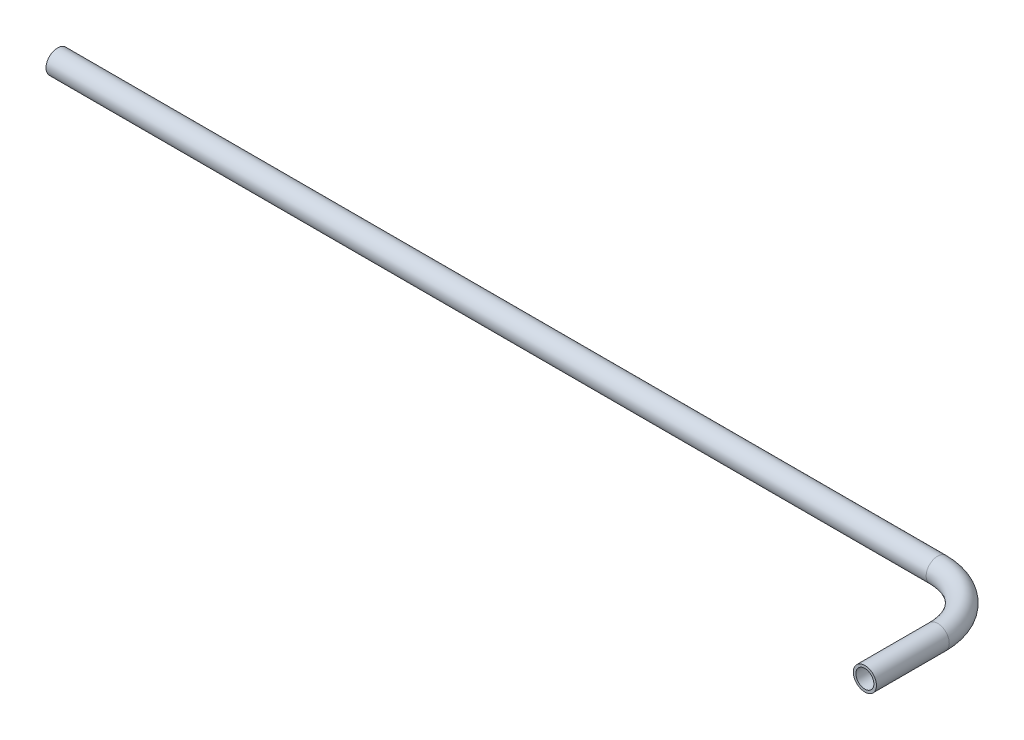
ISO-10303-21;
HEADER;
FILE_DESCRIPTION(('STEP AP214'),'2;1');
FILE_NAME('part.step','',(''),(''),'','','');
FILE_SCHEMA(('AUTOMOTIVE_DESIGN { 1 0 10303 214 1 1 1 1 }'));
ENDSEC;
DATA;
#1=APPLICATION_CONTEXT('core data for automotive mechanical design processes');
#2=APPLICATION_PROTOCOL_DEFINITION('international standard','automotive_design',2000,#1);
#3=PRODUCT_CONTEXT('',#1,'mechanical');
#4=PRODUCT('Part','Part','',(#3));
#5=PRODUCT_RELATED_PRODUCT_CATEGORY('part','',(#4));
#6=PRODUCT_DEFINITION_FORMATION('','',#4);
#7=PRODUCT_DEFINITION_CONTEXT('part definition',#1,'design');
#8=PRODUCT_DEFINITION('design','',#6,#7);
#9=PRODUCT_DEFINITION_SHAPE('','',#8);
#10=(LENGTH_UNIT() NAMED_UNIT(*) SI_UNIT(.MILLI.,.METRE.));
#11=(NAMED_UNIT(*) PLANE_ANGLE_UNIT() SI_UNIT($,.RADIAN.));
#12=(NAMED_UNIT(*) SI_UNIT($,.STERADIAN.) SOLID_ANGLE_UNIT());
#13=UNCERTAINTY_MEASURE_WITH_UNIT(LENGTH_MEASURE(1.E-05),#10,'distance_accuracy_value','');
#14=(GEOMETRIC_REPRESENTATION_CONTEXT(3) GLOBAL_UNCERTAINTY_ASSIGNED_CONTEXT((#13)) GLOBAL_UNIT_ASSIGNED_CONTEXT((#10,
#11,#12)) REPRESENTATION_CONTEXT('',''));
#15=CARTESIAN_POINT('',(0.,0.,0.));
#16=DIRECTION('',(0.,0.,1.));
#17=DIRECTION('',(1.,0.,0.));
#18=AXIS2_PLACEMENT_3D('',#15,#16,#17);
#19=CARTESIAN_POINT('',(-257.7,0.,-36.));
#20=DIRECTION('',(1.,0.,0.));
#21=DIRECTION('',(0.,0.,-1.));
#22=AXIS2_PLACEMENT_3D('',#19,#20,#21);
#23=PLANE('',#22);
#24=CARTESIAN_POINT('',(-257.7,0.,-36.));
#25=DIRECTION('',(1.,0.,0.));
#26=DIRECTION('',(0.,0.,-1.));
#27=AXIS2_PLACEMENT_3D('',#24,#25,#26);
#28=CIRCLE('',#27,2.4638);
#29=CARTESIAN_POINT('',(-257.7,0.,-38.4638));
#30=VERTEX_POINT('',#29);
#31=EDGE_CURVE('E54',#30,#30,#28,.T.);
#32=ORIENTED_EDGE('',*,*,#31,.T.);
#33=EDGE_LOOP('',(#32));
#34=FACE_BOUND('',#33,.T.);
#35=CARTESIAN_POINT('',(-257.7,0.,-36.));
#36=DIRECTION('',(1.,0.,0.));
#37=DIRECTION('',(0.,0.,-1.));
#38=AXIS2_PLACEMENT_3D('',#35,#36,#37);
#39=CIRCLE('',#38,3.175);
#40=CARTESIAN_POINT('',(-257.7,0.,-39.175));
#41=VERTEX_POINT('',#40);
#42=EDGE_CURVE('E45',#41,#41,#39,.T.);
#43=ORIENTED_EDGE('',*,*,#42,.F.);
#44=EDGE_LOOP('',(#43));
#45=FACE_BOUND('',#44,.T.);
#46=ADVANCED_FACE('F31',(#34,#45),#23,.F.);
#47=CARTESIAN_POINT('',(0.,0.,0.));
#48=DIRECTION('',(0.,0.,1.));
#49=DIRECTION('',(1.,0.,0.));
#50=AXIS2_PLACEMENT_3D('',#47,#48,#49);
#51=PLANE('',#50);
#52=CARTESIAN_POINT('',(0.,0.,0.));
#53=DIRECTION('',(0.,0.,1.));
#54=DIRECTION('',(1.,0.,0.));
#55=AXIS2_PLACEMENT_3D('',#52,#53,#54);
#56=CIRCLE('',#55,2.4638);
#57=CARTESIAN_POINT('',(2.4638,0.,0.));
#58=VERTEX_POINT('',#57);
#59=EDGE_CURVE('E50',#58,#58,#56,.T.);
#60=ORIENTED_EDGE('',*,*,#59,.F.);
#61=EDGE_LOOP('',(#60));
#62=FACE_BOUND('',#61,.T.);
#63=CARTESIAN_POINT('',(0.,0.,0.));
#64=DIRECTION('',(0.,0.,1.));
#65=DIRECTION('',(1.,0.,0.));
#66=AXIS2_PLACEMENT_3D('',#63,#64,#65);
#67=CIRCLE('',#66,3.175);
#68=CARTESIAN_POINT('',(3.175,0.,0.));
#69=VERTEX_POINT('',#68);
#70=EDGE_CURVE('E10',#69,#69,#67,.T.);
#71=ORIENTED_EDGE('',*,*,#70,.T.);
#72=EDGE_LOOP('',(#71));
#73=FACE_BOUND('',#72,.T.);
#74=ADVANCED_FACE('F90',(#62,#73),#51,.T.);
#75=CARTESIAN_POINT('',(-257.7,0.,-36.));
#76=DIRECTION('',(1.,0.,0.));
#77=DIRECTION('',(0.,0.,-1.));
#78=AXIS2_PLACEMENT_3D('',#75,#76,#77);
#79=CYLINDRICAL_SURFACE('',#78,3.175);
#80=CARTESIAN_POINT('',(-16.,0.,-36.));
#81=DIRECTION('',(1.,0.,0.));
#82=DIRECTION('',(0.,0.,-1.));
#83=AXIS2_PLACEMENT_3D('',#80,#81,#82);
#84=CIRCLE('',#83,3.175);
#85=CARTESIAN_POINT('',(-16.,0.,-39.175));
#86=VERTEX_POINT('',#85);
#87=EDGE_CURVE('E41',#86,#86,#84,.T.);
#88=ORIENTED_EDGE('',*,*,#87,.F.);
#89=EDGE_LOOP('',(#88));
#90=FACE_BOUND('',#89,.T.);
#91=ORIENTED_EDGE('',*,*,#42,.T.);
#92=EDGE_LOOP('',(#91));
#93=FACE_BOUND('',#92,.T.);
#94=ADVANCED_FACE('F86',(#90,#93),#79,.T.);
#95=CARTESIAN_POINT('',(-16.,0.,-20.));
#96=DIRECTION('',(0.,-1.,0.));
#97=DIRECTION('',(0.,0.,-1.));
#98=AXIS2_PLACEMENT_3D('',#95,#96,#97);
#99=TOROIDAL_SURFACE('',#98,16.,3.175);
#100=CARTESIAN_POINT('',(0.,0.,-20.));
#101=DIRECTION('',(0.,0.,1.));
#102=DIRECTION('',(1.,0.,0.));
#103=AXIS2_PLACEMENT_3D('',#100,#101,#102);
#104=CIRCLE('',#103,3.175);
#105=CARTESIAN_POINT('',(3.17500000000001,0.,-20.));
#106=VERTEX_POINT('',#105);
#107=EDGE_CURVE('E37',#106,#106,#104,.T.);
#108=CARTESIAN_POINT('',(-16.,0.,-20.));
#109=DIRECTION('',(0.,-1.,0.));
#110=DIRECTION('',(0.,0.,-1.));
#111=AXIS2_PLACEMENT_3D('',#108,#109,#110);
#112=CIRCLE('',#111,19.175);
#113=EDGE_CURVE('',#86,#106,#112,.T.);
#114=ORIENTED_EDGE('',*,*,#87,.T.);
#115=ORIENTED_EDGE('',*,*,#107,.F.);
#116=ORIENTED_EDGE('',*,*,#113,.T.);
#117=ORIENTED_EDGE('',*,*,#113,.F.);
#118=EDGE_LOOP('',(#114,#116,#115,#117));
#119=FACE_BOUND('',#118,.T.);
#120=ADVANCED_FACE('F80',(#119),#99,.T.);
#121=CARTESIAN_POINT('',(0.,0.,-20.));
#122=DIRECTION('',(0.,0.,1.));
#123=DIRECTION('',(1.,0.,0.));
#124=AXIS2_PLACEMENT_3D('',#121,#122,#123);
#125=CYLINDRICAL_SURFACE('',#124,3.175);
#126=ORIENTED_EDGE('',*,*,#70,.F.);
#127=EDGE_LOOP('',(#126));
#128=FACE_BOUND('',#127,.T.);
#129=ORIENTED_EDGE('',*,*,#107,.T.);
#130=EDGE_LOOP('',(#129));
#131=FACE_BOUND('',#130,.T.);
#132=ADVANCED_FACE('F77',(#128,#131),#125,.T.);
#133=CARTESIAN_POINT('',(-257.7,0.,-36.));
#134=DIRECTION('',(1.,0.,0.));
#135=DIRECTION('',(0.,0.,-1.));
#136=AXIS2_PLACEMENT_3D('',#133,#134,#135);
#137=CYLINDRICAL_SURFACE('',#136,2.4638);
#138=CARTESIAN_POINT('',(-16.,0.,-36.));
#139=DIRECTION('',(-1.,0.,0.));
#140=DIRECTION('',(0.,0.,1.));
#141=AXIS2_PLACEMENT_3D('',#138,#139,#140);
#142=CIRCLE('',#141,2.4638);
#143=CARTESIAN_POINT('',(-16.,0.,-38.4638));
#144=VERTEX_POINT('',#143);
#145=EDGE_CURVE('E57',#144,#144,#142,.F.);
#146=ORIENTED_EDGE('',*,*,#145,.T.);
#147=EDGE_LOOP('',(#146));
#148=FACE_BOUND('',#147,.T.);
#149=ORIENTED_EDGE('',*,*,#31,.F.);
#150=EDGE_LOOP('',(#149));
#151=FACE_BOUND('',#150,.T.);
#152=ADVANCED_FACE('F63',(#148,#151),#137,.F.);
#153=CARTESIAN_POINT('',(-16.,0.,-20.));
#154=DIRECTION('',(0.,-1.,0.));
#155=DIRECTION('',(0.,0.,-1.));
#156=AXIS2_PLACEMENT_3D('',#153,#154,#155);
#157=TOROIDAL_SURFACE('',#156,16.,2.4638);
#158=CARTESIAN_POINT('',(0.,0.,-20.));
#159=DIRECTION('',(0.,0.,1.));
#160=DIRECTION('',(1.,0.,0.));
#161=AXIS2_PLACEMENT_3D('',#158,#159,#160);
#162=CIRCLE('',#161,2.4638);
#163=CARTESIAN_POINT('',(2.46380000000001,0.,-20.));
#164=VERTEX_POINT('',#163);
#165=EDGE_CURVE('E53',#164,#164,#162,.T.);
#166=CARTESIAN_POINT('',(-16.,0.,-20.));
#167=DIRECTION('',(0.,-1.,0.));
#168=DIRECTION('',(0.,0.,-1.));
#169=AXIS2_PLACEMENT_3D('',#166,#167,#168);
#170=CIRCLE('',#169,18.4638);
#171=EDGE_CURVE('',#144,#164,#170,.T.);
#172=ORIENTED_EDGE('',*,*,#145,.F.);
#173=ORIENTED_EDGE('',*,*,#165,.T.);
#174=ORIENTED_EDGE('',*,*,#171,.T.);
#175=ORIENTED_EDGE('',*,*,#171,.F.);
#176=EDGE_LOOP('',(#172,#174,#173,#175));
#177=FACE_BOUND('',#176,.T.);
#178=ADVANCED_FACE('F66',(#177),#157,.F.);
#179=CARTESIAN_POINT('',(0.,0.,-20.));
#180=DIRECTION('',(0.,0.,1.));
#181=DIRECTION('',(1.,0.,0.));
#182=AXIS2_PLACEMENT_3D('',#179,#180,#181);
#183=CYLINDRICAL_SURFACE('',#182,2.4638);
#184=ORIENTED_EDGE('',*,*,#59,.T.);
#185=EDGE_LOOP('',(#184));
#186=FACE_BOUND('',#185,.T.);
#187=ORIENTED_EDGE('',*,*,#165,.F.);
#188=EDGE_LOOP('',(#187));
#189=FACE_BOUND('',#188,.T.);
#190=ADVANCED_FACE('F68',(#186,#189),#183,.F.);
#191=CLOSED_SHELL('',(#46,#74,#94,#120,#132,#152,#178,#190));
#192=MANIFOLD_SOLID_BREP('B2',#191);
#193=ADVANCED_BREP_SHAPE_REPRESENTATION('',(#18,#192),#14);
#194=SHAPE_DEFINITION_REPRESENTATION(#9,#193);
ENDSEC;
END-ISO-10303-21;
